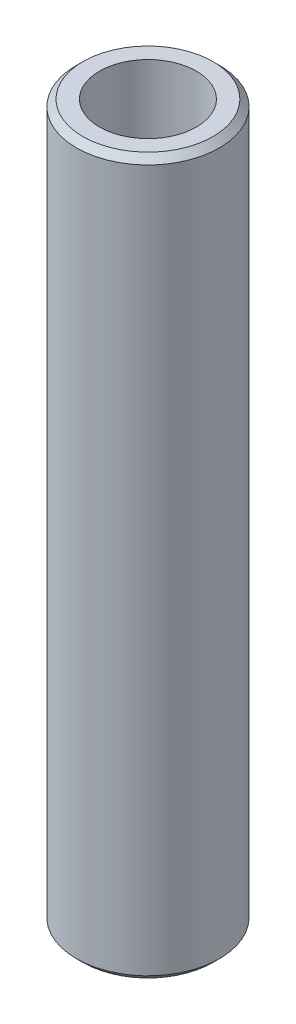
ISO-10303-21;
HEADER;
FILE_DESCRIPTION(('STEP AP214'),'2;1');
FILE_NAME('part.step','',(''),(''),'','','');
FILE_SCHEMA(('AUTOMOTIVE_DESIGN { 1 0 10303 214 1 1 1 1 }'));
ENDSEC;
DATA;
#1=APPLICATION_CONTEXT('core data for automotive mechanical design processes');
#2=APPLICATION_PROTOCOL_DEFINITION('international standard','automotive_design',2000,#1);
#3=PRODUCT_CONTEXT('',#1,'mechanical');
#4=PRODUCT('Part','Part','',(#3));
#5=PRODUCT_RELATED_PRODUCT_CATEGORY('part','',(#4));
#6=PRODUCT_DEFINITION_FORMATION('','',#4);
#7=PRODUCT_DEFINITION_CONTEXT('part definition',#1,'design');
#8=PRODUCT_DEFINITION('design','',#6,#7);
#9=PRODUCT_DEFINITION_SHAPE('','',#8);
#10=(LENGTH_UNIT() NAMED_UNIT(*) SI_UNIT(.MILLI.,.METRE.));
#11=(NAMED_UNIT(*) PLANE_ANGLE_UNIT() SI_UNIT($,.RADIAN.));
#12=(NAMED_UNIT(*) SI_UNIT($,.STERADIAN.) SOLID_ANGLE_UNIT());
#13=UNCERTAINTY_MEASURE_WITH_UNIT(LENGTH_MEASURE(1.E-05),#10,'distance_accuracy_value','');
#14=(GEOMETRIC_REPRESENTATION_CONTEXT(3) GLOBAL_UNCERTAINTY_ASSIGNED_CONTEXT((#13)) GLOBAL_UNIT_ASSIGNED_CONTEXT((#10,
#11,#12)) REPRESENTATION_CONTEXT('',''));
#15=CARTESIAN_POINT('',(0.,0.,0.));
#16=DIRECTION('',(0.,0.,1.));
#17=DIRECTION('',(1.,0.,0.));
#18=AXIS2_PLACEMENT_3D('',#15,#16,#17);
#19=CARTESIAN_POINT('',(0.,600.,0.));
#20=DIRECTION('',(0.,-1.,0.));
#21=DIRECTION('',(0.,0.,-1.));
#22=AXIS2_PLACEMENT_3D('',#19,#20,#21);
#23=CYLINDRICAL_SURFACE('',#22,60.);
#24=CARTESIAN_POINT('',(0.,594.544966341194,0.));
#25=DIRECTION('',(0.,1.,0.));
#26=DIRECTION('',(0.,0.,1.));
#27=AXIS2_PLACEMENT_3D('',#24,#25,#26);
#28=CIRCLE('',#27,60.);
#29=CARTESIAN_POINT('',(0.,594.544966341194,60.));
#30=VERTEX_POINT('',#29);
#31=EDGE_CURVE('E50',#30,#30,#28,.F.);
#32=ORIENTED_EDGE('',*,*,#31,.T.);
#33=EDGE_LOOP('',(#32));
#34=FACE_BOUND('',#33,.T.);
#35=CARTESIAN_POINT('',(0.,5.45503365880595,0.));
#36=DIRECTION('',(0.,1.,0.));
#37=DIRECTION('',(0.,0.,1.));
#38=AXIS2_PLACEMENT_3D('',#35,#36,#37);
#39=CIRCLE('',#38,60.);
#40=CARTESIAN_POINT('',(0.,5.45503365880595,60.));
#41=VERTEX_POINT('',#40);
#42=EDGE_CURVE('E51',#41,#41,#39,.T.);
#43=ORIENTED_EDGE('',*,*,#42,.T.);
#44=EDGE_LOOP('',(#43));
#45=FACE_BOUND('',#44,.T.);
#46=ADVANCED_FACE('F39',(#34,#45),#23,.T.);
#47=CARTESIAN_POINT('',(0.,600.,0.));
#48=DIRECTION('',(0.,1.,0.));
#49=DIRECTION('',(0.,0.,1.));
#50=AXIS2_PLACEMENT_3D('',#47,#48,#49);
#51=PLANE('',#50);
#52=CARTESIAN_POINT('',(0.,600.,0.));
#53=DIRECTION('',(0.,1.,0.));
#54=DIRECTION('',(0.,0.,1.));
#55=AXIS2_PLACEMENT_3D('',#52,#53,#54);
#56=CIRCLE('',#55,54.544966341194);
#57=CARTESIAN_POINT('',(0.,600.,54.544966341194));
#58=VERTEX_POINT('',#57);
#59=EDGE_CURVE('E54',#58,#58,#56,.T.);
#60=ORIENTED_EDGE('',*,*,#59,.T.);
#61=EDGE_LOOP('',(#60));
#62=FACE_BOUND('',#61,.T.);
#63=CARTESIAN_POINT('',(0.,600.,0.));
#64=DIRECTION('',(0.,1.,0.));
#65=DIRECTION('',(0.,0.,1.));
#66=AXIS2_PLACEMENT_3D('',#63,#64,#65);
#67=CIRCLE('',#66,40.6554682511085);
#68=CARTESIAN_POINT('',(0.,600.,40.6554682511085));
#69=VERTEX_POINT('',#68);
#70=EDGE_CURVE('E58',#69,#69,#67,.T.);
#71=ORIENTED_EDGE('',*,*,#70,.F.);
#72=EDGE_LOOP('',(#71));
#73=FACE_BOUND('',#72,.T.);
#74=ADVANCED_FACE('F69',(#62,#73),#51,.T.);
#75=CARTESIAN_POINT('',(0.,0.,0.));
#76=DIRECTION('',(0.,1.,0.));
#77=DIRECTION('',(0.,0.,1.));
#78=AXIS2_PLACEMENT_3D('',#75,#76,#77);
#79=PLANE('',#78);
#80=CARTESIAN_POINT('',(0.,0.,0.));
#81=DIRECTION('',(0.,1.,0.));
#82=DIRECTION('',(0.,0.,1.));
#83=AXIS2_PLACEMENT_3D('',#80,#81,#82);
#84=CIRCLE('',#83,54.544966341194);
#85=CARTESIAN_POINT('',(0.,0.,54.544966341194));
#86=VERTEX_POINT('',#85);
#87=EDGE_CURVE('E10',#86,#86,#84,.F.);
#88=ORIENTED_EDGE('',*,*,#87,.T.);
#89=EDGE_LOOP('',(#88));
#90=FACE_BOUND('',#89,.T.);
#91=CARTESIAN_POINT('',(0.,0.,0.));
#92=DIRECTION('',(0.,1.,0.));
#93=DIRECTION('',(0.,0.,1.));
#94=AXIS2_PLACEMENT_3D('',#91,#92,#93);
#95=CIRCLE('',#94,40.6554682511085);
#96=CARTESIAN_POINT('',(0.,0.,40.6554682511085));
#97=VERTEX_POINT('',#96);
#98=EDGE_CURVE('E63',#97,#97,#95,.T.);
#99=ORIENTED_EDGE('',*,*,#98,.T.);
#100=EDGE_LOOP('',(#99));
#101=FACE_BOUND('',#100,.T.);
#102=ADVANCED_FACE('F75',(#90,#101),#79,.F.);
#103=CARTESIAN_POINT('',(0.,600.,0.));
#104=DIRECTION('',(0.,-1.,0.));
#105=DIRECTION('',(0.,0.,-1.));
#106=AXIS2_PLACEMENT_3D('',#103,#104,#105);
#107=CYLINDRICAL_SURFACE('',#106,40.6554682511085);
#108=ORIENTED_EDGE('',*,*,#70,.T.);
#109=EDGE_LOOP('',(#108));
#110=FACE_BOUND('',#109,.T.);
#111=ORIENTED_EDGE('',*,*,#98,.F.);
#112=EDGE_LOOP('',(#111));
#113=FACE_BOUND('',#112,.T.);
#114=ADVANCED_FACE('F70',(#110,#113),#107,.F.);
#115=CARTESIAN_POINT('',(0.,600.,0.));
#116=DIRECTION('',(0.,-1.,0.));
#117=DIRECTION('',(0.,0.,-1.));
#118=AXIS2_PLACEMENT_3D('',#115,#116,#117);
#119=CONICAL_SURFACE('',#118,54.544966341194,0.785398163397428);
#120=ORIENTED_EDGE('',*,*,#31,.F.);
#121=EDGE_LOOP('',(#120));
#122=FACE_BOUND('',#121,.T.);
#123=ORIENTED_EDGE('',*,*,#59,.F.);
#124=EDGE_LOOP('',(#123));
#125=FACE_BOUND('',#124,.T.);
#126=ADVANCED_FACE('F81',(#122,#125),#119,.T.);
#127=CARTESIAN_POINT('',(0.,5.45503365880595,0.));
#128=DIRECTION('',(0.,1.,0.));
#129=DIRECTION('',(0.,0.,1.));
#130=AXIS2_PLACEMENT_3D('',#127,#128,#129);
#131=CONICAL_SURFACE('',#130,60.,0.785398163397453);
#132=ORIENTED_EDGE('',*,*,#87,.F.);
#133=EDGE_LOOP('',(#132));
#134=FACE_BOUND('',#133,.T.);
#135=ORIENTED_EDGE('',*,*,#42,.F.);
#136=EDGE_LOOP('',(#135));
#137=FACE_BOUND('',#136,.T.);
#138=ADVANCED_FACE('F45',(#134,#137),#131,.T.);
#139=CLOSED_SHELL('',(#46,#74,#102,#114,#126,#138));
#140=MANIFOLD_SOLID_BREP('B2',#139);
#141=ADVANCED_BREP_SHAPE_REPRESENTATION('',(#18,#140),#14);
#142=SHAPE_DEFINITION_REPRESENTATION(#9,#141);
ENDSEC;
END-ISO-10303-21;
